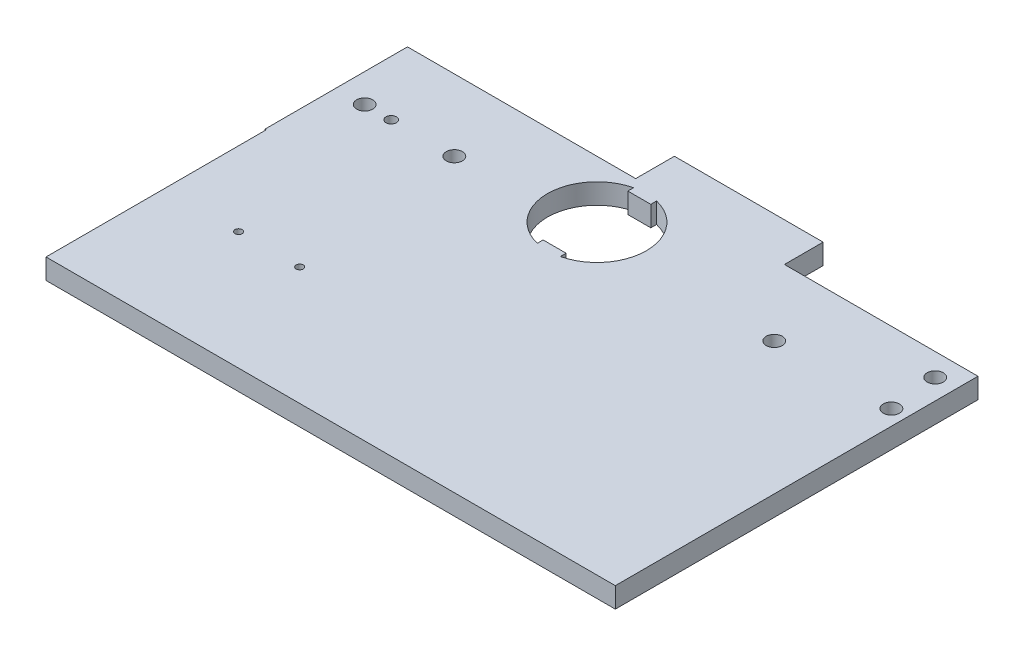
ISO-10303-21;
HEADER;
FILE_DESCRIPTION(('STEP AP214'),'2;1');
FILE_NAME('part.step','',(''),(''),'','','');
FILE_SCHEMA(('AUTOMOTIVE_DESIGN { 1 0 10303 214 1 1 1 1 }'));
ENDSEC;
DATA;
#1=APPLICATION_CONTEXT('core data for automotive mechanical design processes');
#2=APPLICATION_PROTOCOL_DEFINITION('international standard','automotive_design',2000,#1);
#3=PRODUCT_CONTEXT('',#1,'mechanical');
#4=PRODUCT('Part','Part','',(#3));
#5=PRODUCT_RELATED_PRODUCT_CATEGORY('part','',(#4));
#6=PRODUCT_DEFINITION_FORMATION('','',#4);
#7=PRODUCT_DEFINITION_CONTEXT('part definition',#1,'design');
#8=PRODUCT_DEFINITION('design','',#6,#7);
#9=PRODUCT_DEFINITION_SHAPE('','',#8);
#10=(LENGTH_UNIT() NAMED_UNIT(*) SI_UNIT(.MILLI.,.METRE.));
#11=(NAMED_UNIT(*) PLANE_ANGLE_UNIT() SI_UNIT($,.RADIAN.));
#12=(NAMED_UNIT(*) SI_UNIT($,.STERADIAN.) SOLID_ANGLE_UNIT());
#13=UNCERTAINTY_MEASURE_WITH_UNIT(LENGTH_MEASURE(1.E-05),#10,'distance_accuracy_value','');
#14=(GEOMETRIC_REPRESENTATION_CONTEXT(3) GLOBAL_UNCERTAINTY_ASSIGNED_CONTEXT((#13)) GLOBAL_UNIT_ASSIGNED_CONTEXT((#10,
#11,#12)) REPRESENTATION_CONTEXT('',''));
#15=CARTESIAN_POINT('',(0.,0.,0.));
#16=DIRECTION('',(0.,0.,1.));
#17=DIRECTION('',(1.,0.,0.));
#18=AXIS2_PLACEMENT_3D('',#15,#16,#17);
#19=CARTESIAN_POINT('',(0.,10.,-70.));
#20=DIRECTION('',(0.,0.,-1.));
#21=DIRECTION('',(-1.,0.,0.));
#22=AXIS2_PLACEMENT_3D('',#19,#20,#21);
#23=PLANE('',#22);
#24=DIRECTION('',(0.,-1.,0.));
#25=VECTOR('',#24,1.);
#26=CARTESIAN_POINT('',(185.,10.0000000000001,-70.));
#27=LINE('',#26,#25);
#28=CARTESIAN_POINT('',(185.,10.,-70.));
#29=VERTEX_POINT('',#28);
#30=CARTESIAN_POINT('',(185.,0.,-70.));
#31=VERTEX_POINT('',#30);
#32=EDGE_CURVE('E54',#29,#31,#27,.T.);
#33=ORIENTED_EDGE('',*,*,#32,.F.);
#34=DIRECTION('',(1.,0.,0.));
#35=VECTOR('',#34,1.);
#36=CARTESIAN_POINT('',(0.,10.,-70.));
#37=LINE('',#36,#35);
#38=CARTESIAN_POINT('',(280.,10.,-70.));
#39=VERTEX_POINT('',#38);
#40=EDGE_CURVE('E281',#29,#39,#37,.T.);
#41=ORIENTED_EDGE('',*,*,#40,.T.);
#42=DIRECTION('',(0.,-1.,0.));
#43=VECTOR('',#42,1.);
#44=CARTESIAN_POINT('',(280.,10.,-70.));
#45=LINE('',#44,#43);
#46=CARTESIAN_POINT('',(280.,0.,-70.));
#47=VERTEX_POINT('',#46);
#48=EDGE_CURVE('E11',#39,#47,#45,.T.);
#49=ORIENTED_EDGE('',*,*,#48,.T.);
#50=DIRECTION('',(1.,0.,0.));
#51=VECTOR('',#50,1.);
#52=CARTESIAN_POINT('',(0.,0.,-70.));
#53=LINE('',#52,#51);
#54=EDGE_CURVE('E58',#31,#47,#53,.T.);
#55=ORIENTED_EDGE('',*,*,#54,.F.);
#56=EDGE_LOOP('',(#33,#41,#49,#55));
#57=FACE_BOUND('',#56,.T.);
#58=ADVANCED_FACE('F37',(#57),#23,.T.);
#59=CARTESIAN_POINT('',(0.,10.,0.));
#60=DIRECTION('',(0.,0.,-1.));
#61=DIRECTION('',(-1.,0.,0.));
#62=AXIS2_PLACEMENT_3D('',#59,#60,#61);
#63=PLANE('',#62);
#64=DIRECTION('',(1.,0.,0.));
#65=VECTOR('',#64,1.);
#66=CARTESIAN_POINT('',(0.,0.,0.));
#67=LINE('',#66,#65);
#68=CARTESIAN_POINT('',(0.,0.,0.));
#69=VERTEX_POINT('',#68);
#70=CARTESIAN_POINT('',(0.600000000000045,0.,0.));
#71=VERTEX_POINT('',#70);
#72=EDGE_CURVE('E272',#69,#71,#67,.T.);
#73=ORIENTED_EDGE('',*,*,#72,.T.);
#74=DIRECTION('',(0.,1.,0.));
#75=VECTOR('',#74,1.);
#76=CARTESIAN_POINT('',(0.600000000000045,0.,0.));
#77=LINE('',#76,#75);
#78=CARTESIAN_POINT('',(0.600000000000045,10.,0.));
#79=VERTEX_POINT('',#78);
#80=EDGE_CURVE('E240',#71,#79,#77,.T.);
#81=ORIENTED_EDGE('',*,*,#80,.T.);
#82=DIRECTION('',(1.,0.,0.));
#83=VECTOR('',#82,1.);
#84=CARTESIAN_POINT('',(0.,10.,0.));
#85=LINE('',#84,#83);
#86=CARTESIAN_POINT('',(0.,10.,0.));
#87=VERTEX_POINT('',#86);
#88=EDGE_CURVE('E274',#87,#79,#85,.T.);
#89=ORIENTED_EDGE('',*,*,#88,.F.);
#90=DIRECTION('',(0.,-1.,0.));
#91=VECTOR('',#90,1.);
#92=CARTESIAN_POINT('',(0.,10.,0.));
#93=LINE('',#92,#91);
#94=EDGE_CURVE('E305',#87,#69,#93,.T.);
#95=ORIENTED_EDGE('',*,*,#94,.T.);
#96=EDGE_LOOP('',(#73,#81,#89,#95));
#97=FACE_BOUND('',#96,.T.);
#98=ADVANCED_FACE('F39',(#97),#63,.F.);
#99=CARTESIAN_POINT('',(280.,10.,0.));
#100=DIRECTION('',(-1.,0.,0.));
#101=DIRECTION('',(0.,0.,1.));
#102=AXIS2_PLACEMENT_3D('',#99,#100,#101);
#103=PLANE('',#102);
#104=ORIENTED_EDGE('',*,*,#48,.F.);
#105=DIRECTION('',(0.,0.,-1.));
#106=VECTOR('',#105,1.);
#107=CARTESIAN_POINT('',(280.,10.,0.));
#108=LINE('',#107,#106);
#109=CARTESIAN_POINT('',(280.,10.,108.));
#110=VERTEX_POINT('',#109);
#111=EDGE_CURVE('E277',#110,#39,#108,.T.);
#112=ORIENTED_EDGE('',*,*,#111,.F.);
#113=DIRECTION('',(0.,1.,0.));
#114=VECTOR('',#113,1.);
#115=CARTESIAN_POINT('',(280.,0.,108.));
#116=LINE('',#115,#114);
#117=CARTESIAN_POINT('',(280.,0.,108.));
#118=VERTEX_POINT('',#117);
#119=EDGE_CURVE('E258',#118,#110,#116,.T.);
#120=ORIENTED_EDGE('',*,*,#119,.F.);
#121=DIRECTION('',(0.,0.,-1.));
#122=VECTOR('',#121,1.);
#123=CARTESIAN_POINT('',(280.,0.,0.));
#124=LINE('',#123,#122);
#125=EDGE_CURVE('E308',#118,#47,#124,.T.);
#126=ORIENTED_EDGE('',*,*,#125,.T.);
#127=EDGE_LOOP('',(#104,#112,#120,#126));
#128=FACE_BOUND('',#127,.T.);
#129=ADVANCED_FACE('F361',(#128),#103,.F.);
#130=DIRECTION('',(0.,1.,0.));
#131=VECTOR('',#130,1.);
#132=CARTESIAN_POINT('',(112.,10.0000000000001,-70.));
#133=LINE('',#132,#131);
#134=CARTESIAN_POINT('',(112.,0.,-70.));
#135=VERTEX_POINT('',#134);
#136=CARTESIAN_POINT('',(112.,10.0000000000001,-70.));
#137=VERTEX_POINT('',#136);
#138=EDGE_CURVE('E182',#135,#137,#133,.T.);
#139=ORIENTED_EDGE('',*,*,#138,.F.);
#140=CARTESIAN_POINT('',(0.,0.,-70.));
#141=VERTEX_POINT('',#140);
#142=EDGE_CURVE('E311',#141,#135,#53,.T.);
#143=ORIENTED_EDGE('',*,*,#142,.F.);
#144=DIRECTION('',(0.,-1.,0.));
#145=VECTOR('',#144,1.);
#146=CARTESIAN_POINT('',(0.,10.,-70.));
#147=LINE('',#146,#145);
#148=CARTESIAN_POINT('',(0.,10.,-70.));
#149=VERTEX_POINT('',#148);
#150=EDGE_CURVE('E46',#149,#141,#147,.T.);
#151=ORIENTED_EDGE('',*,*,#150,.F.);
#152=EDGE_CURVE('E282',#149,#137,#37,.T.);
#153=ORIENTED_EDGE('',*,*,#152,.T.);
#154=EDGE_LOOP('',(#139,#143,#151,#153));
#155=FACE_BOUND('',#154,.T.);
#156=ADVANCED_FACE('F357',(#155),#23,.T.);
#157=CARTESIAN_POINT('',(270.,10.,-59.));
#158=DIRECTION('',(0.,-1.,0.));
#159=DIRECTION('',(0.,0.,-1.));
#160=AXIS2_PLACEMENT_3D('',#157,#158,#159);
#161=CYLINDRICAL_SURFACE('',#160,3.96875000000005);
#162=CARTESIAN_POINT('',(270.,10.,-59.));
#163=DIRECTION('',(0.,1.,0.));
#164=DIRECTION('',(0.,0.,1.));
#165=AXIS2_PLACEMENT_3D('',#162,#163,#164);
#166=CIRCLE('',#165,3.96875000000005);
#167=CARTESIAN_POINT('',(270.,10.,-55.03125));
#168=VERTEX_POINT('',#167);
#169=EDGE_CURVE('E299',#168,#168,#166,.T.);
#170=ORIENTED_EDGE('',*,*,#169,.T.);
#171=EDGE_LOOP('',(#170));
#172=FACE_BOUND('',#171,.T.);
#173=CARTESIAN_POINT('',(270.,0.,-59.));
#174=DIRECTION('',(0.,1.,0.));
#175=DIRECTION('',(0.,0.,1.));
#176=AXIS2_PLACEMENT_3D('',#173,#174,#175);
#177=CIRCLE('',#176,3.96875000000005);
#178=CARTESIAN_POINT('',(270.,0.,-55.03125));
#179=VERTEX_POINT('',#178);
#180=EDGE_CURVE('E328',#179,#179,#177,.T.);
#181=ORIENTED_EDGE('',*,*,#180,.F.);
#182=EDGE_LOOP('',(#181));
#183=FACE_BOUND('',#182,.T.);
#184=ADVANCED_FACE('F365',(#172,#183),#161,.F.);
#185=CARTESIAN_POINT('',(272.5,10.,-35.));
#186=DIRECTION('',(0.,-1.,0.));
#187=DIRECTION('',(0.,0.,-1.));
#188=AXIS2_PLACEMENT_3D('',#185,#186,#187);
#189=CYLINDRICAL_SURFACE('',#188,3.96874999999999);
#190=CARTESIAN_POINT('',(272.5,10.,-35.));
#191=DIRECTION('',(0.,1.,0.));
#192=DIRECTION('',(0.,0.,1.));
#193=AXIS2_PLACEMENT_3D('',#190,#191,#192);
#194=CIRCLE('',#193,3.96874999999999);
#195=CARTESIAN_POINT('',(272.5,10.,-31.03125));
#196=VERTEX_POINT('',#195);
#197=EDGE_CURVE('E296',#196,#196,#194,.T.);
#198=ORIENTED_EDGE('',*,*,#197,.T.);
#199=EDGE_LOOP('',(#198));
#200=FACE_BOUND('',#199,.T.);
#201=CARTESIAN_POINT('',(272.5,0.,-35.));
#202=DIRECTION('',(0.,1.,0.));
#203=DIRECTION('',(0.,0.,1.));
#204=AXIS2_PLACEMENT_3D('',#201,#202,#203);
#205=CIRCLE('',#204,3.96874999999999);
#206=CARTESIAN_POINT('',(272.5,0.,-31.03125));
#207=VERTEX_POINT('',#206);
#208=EDGE_CURVE('E325',#207,#207,#205,.T.);
#209=ORIENTED_EDGE('',*,*,#208,.F.);
#210=EDGE_LOOP('',(#209));
#211=FACE_BOUND('',#210,.T.);
#212=ADVANCED_FACE('F371',(#200,#211),#189,.F.);
#213=CARTESIAN_POINT('',(58.,10.,-35.));
#214=DIRECTION('',(0.,-1.,0.));
#215=DIRECTION('',(0.,0.,-1.));
#216=AXIS2_PLACEMENT_3D('',#213,#214,#215);
#217=CYLINDRICAL_SURFACE('',#216,3.96875000000001);
#218=CARTESIAN_POINT('',(58.,10.,-35.));
#219=DIRECTION('',(0.,1.,0.));
#220=DIRECTION('',(0.,0.,1.));
#221=AXIS2_PLACEMENT_3D('',#218,#219,#220);
#222=CIRCLE('',#221,3.96875000000001);
#223=CARTESIAN_POINT('',(58.,10.,-31.03125));
#224=VERTEX_POINT('',#223);
#225=EDGE_CURVE('E293',#224,#224,#222,.T.);
#226=ORIENTED_EDGE('',*,*,#225,.T.);
#227=EDGE_LOOP('',(#226));
#228=FACE_BOUND('',#227,.T.);
#229=CARTESIAN_POINT('',(58.,0.,-35.));
#230=DIRECTION('',(0.,1.,0.));
#231=DIRECTION('',(0.,0.,1.));
#232=AXIS2_PLACEMENT_3D('',#229,#230,#231);
#233=CIRCLE('',#232,3.96875000000001);
#234=CARTESIAN_POINT('',(58.,0.,-31.03125));
#235=VERTEX_POINT('',#234);
#236=EDGE_CURVE('E322',#235,#235,#233,.T.);
#237=ORIENTED_EDGE('',*,*,#236,.F.);
#238=EDGE_LOOP('',(#237));
#239=FACE_BOUND('',#238,.T.);
#240=ADVANCED_FACE('F422',(#228,#239),#217,.F.);
#241=CARTESIAN_POINT('',(14.,10.,-35.));
#242=DIRECTION('',(0.,-1.,0.));
#243=DIRECTION('',(0.,0.,-1.));
#244=AXIS2_PLACEMENT_3D('',#241,#242,#243);
#245=CYLINDRICAL_SURFACE('',#244,3.96875);
#246=CARTESIAN_POINT('',(14.,10.,-35.));
#247=DIRECTION('',(0.,1.,0.));
#248=DIRECTION('',(0.,0.,1.));
#249=AXIS2_PLACEMENT_3D('',#246,#247,#248);
#250=CIRCLE('',#249,3.96875);
#251=CARTESIAN_POINT('',(14.,10.,-31.03125));
#252=VERTEX_POINT('',#251);
#253=EDGE_CURVE('E290',#252,#252,#250,.T.);
#254=ORIENTED_EDGE('',*,*,#253,.T.);
#255=EDGE_LOOP('',(#254));
#256=FACE_BOUND('',#255,.T.);
#257=CARTESIAN_POINT('',(14.,0.,-35.));
#258=DIRECTION('',(0.,1.,0.));
#259=DIRECTION('',(0.,0.,1.));
#260=AXIS2_PLACEMENT_3D('',#257,#258,#259);
#261=CIRCLE('',#260,3.96875);
#262=CARTESIAN_POINT('',(14.,0.,-31.03125));
#263=VERTEX_POINT('',#262);
#264=EDGE_CURVE('E319',#263,#263,#261,.T.);
#265=ORIENTED_EDGE('',*,*,#264,.F.);
#266=EDGE_LOOP('',(#265));
#267=FACE_BOUND('',#266,.T.);
#268=ADVANCED_FACE('F416',(#256,#267),#245,.F.);
#269=CARTESIAN_POINT('',(27.,10.,-35.));
#270=DIRECTION('',(0.,-1.,0.));
#271=DIRECTION('',(0.,0.,-1.));
#272=AXIS2_PLACEMENT_3D('',#269,#270,#271);
#273=CYLINDRICAL_SURFACE('',#272,2.54999999999999);
#274=CARTESIAN_POINT('',(27.,10.,-35.));
#275=DIRECTION('',(0.,1.,0.));
#276=DIRECTION('',(0.,0.,1.));
#277=AXIS2_PLACEMENT_3D('',#274,#275,#276);
#278=CIRCLE('',#277,2.54999999999999);
#279=CARTESIAN_POINT('',(27.,10.,-32.45));
#280=VERTEX_POINT('',#279);
#281=EDGE_CURVE('E287',#280,#280,#278,.T.);
#282=ORIENTED_EDGE('',*,*,#281,.T.);
#283=EDGE_LOOP('',(#282));
#284=FACE_BOUND('',#283,.T.);
#285=CARTESIAN_POINT('',(27.,0.,-35.));
#286=DIRECTION('',(0.,1.,0.));
#287=DIRECTION('',(0.,0.,1.));
#288=AXIS2_PLACEMENT_3D('',#285,#286,#287);
#289=CIRCLE('',#288,2.54999999999999);
#290=CARTESIAN_POINT('',(27.,0.,-32.45));
#291=VERTEX_POINT('',#290);
#292=EDGE_CURVE('E316',#291,#291,#289,.T.);
#293=ORIENTED_EDGE('',*,*,#292,.F.);
#294=EDGE_LOOP('',(#293));
#295=FACE_BOUND('',#294,.T.);
#296=ADVANCED_FACE('F409',(#284,#295),#273,.F.);
#297=CARTESIAN_POINT('',(0.,10.,0.));
#298=DIRECTION('',(-1.,0.,0.));
#299=DIRECTION('',(0.,0.,1.));
#300=AXIS2_PLACEMENT_3D('',#297,#298,#299);
#301=PLANE('',#300);
#302=DIRECTION('',(0.,0.,-1.));
#303=VECTOR('',#302,1.);
#304=CARTESIAN_POINT('',(0.,0.,0.));
#305=LINE('',#304,#303);
#306=EDGE_CURVE('E313',#69,#141,#305,.T.);
#307=ORIENTED_EDGE('',*,*,#306,.F.);
#308=ORIENTED_EDGE('',*,*,#94,.F.);
#309=DIRECTION('',(0.,0.,-1.));
#310=VECTOR('',#309,1.);
#311=CARTESIAN_POINT('',(0.,10.,0.));
#312=LINE('',#311,#310);
#313=EDGE_CURVE('E284',#87,#149,#312,.T.);
#314=ORIENTED_EDGE('',*,*,#313,.T.);
#315=ORIENTED_EDGE('',*,*,#150,.T.);
#316=EDGE_LOOP('',(#307,#308,#314,#315));
#317=FACE_BOUND('',#316,.T.);
#318=ADVANCED_FACE('F405',(#317),#301,.T.);
#319=CARTESIAN_POINT('',(215.,10.,-35.));
#320=DIRECTION('',(0.,-1.,0.));
#321=DIRECTION('',(0.,0.,-1.));
#322=AXIS2_PLACEMENT_3D('',#319,#320,#321);
#323=CYLINDRICAL_SURFACE('',#322,3.96874999999999);
#324=CARTESIAN_POINT('',(215.,10.,-35.));
#325=DIRECTION('',(0.,1.,0.));
#326=DIRECTION('',(0.,0.,1.));
#327=AXIS2_PLACEMENT_3D('',#324,#325,#326);
#328=CIRCLE('',#327,3.96874999999999);
#329=CARTESIAN_POINT('',(215.,10.,-31.03125));
#330=VERTEX_POINT('',#329);
#331=EDGE_CURVE('E302',#330,#330,#328,.T.);
#332=ORIENTED_EDGE('',*,*,#331,.T.);
#333=EDGE_LOOP('',(#332));
#334=FACE_BOUND('',#333,.T.);
#335=CARTESIAN_POINT('',(215.,0.,-35.));
#336=DIRECTION('',(0.,1.,0.));
#337=DIRECTION('',(0.,0.,1.));
#338=AXIS2_PLACEMENT_3D('',#335,#336,#337);
#339=CIRCLE('',#338,3.96874999999999);
#340=CARTESIAN_POINT('',(215.,0.,-31.03125));
#341=VERTEX_POINT('',#340);
#342=EDGE_CURVE('E278',#341,#341,#339,.T.);
#343=ORIENTED_EDGE('',*,*,#342,.F.);
#344=EDGE_LOOP('',(#343));
#345=FACE_BOUND('',#344,.T.);
#346=ADVANCED_FACE('F408',(#334,#345),#323,.F.);
#347=CARTESIAN_POINT('',(0.,10.,0.));
#348=DIRECTION('',(0.,1.,0.));
#349=DIRECTION('',(0.,0.,1.));
#350=AXIS2_PLACEMENT_3D('',#347,#348,#349);
#351=PLANE('',#350);
#352=ORIENTED_EDGE('',*,*,#88,.T.);
#353=DIRECTION('',(0.,0.,-1.));
#354=VECTOR('',#353,1.);
#355=CARTESIAN_POINT('',(0.600000000000045,10.,108.));
#356=LINE('',#355,#354);
#357=CARTESIAN_POINT('',(0.600000000000045,10.,108.));
#358=VERTEX_POINT('',#357);
#359=EDGE_CURVE('E270',#358,#79,#356,.T.);
#360=ORIENTED_EDGE('',*,*,#359,.F.);
#361=DIRECTION('',(1.,0.,0.));
#362=VECTOR('',#361,1.);
#363=CARTESIAN_POINT('',(0.600000000000045,10.,108.));
#364=LINE('',#363,#362);
#365=EDGE_CURVE('E255',#358,#110,#364,.T.);
#366=ORIENTED_EDGE('',*,*,#365,.T.);
#367=ORIENTED_EDGE('',*,*,#111,.T.);
#368=ORIENTED_EDGE('',*,*,#40,.F.);
#369=DIRECTION('',(0.,0.,1.));
#370=VECTOR('',#369,1.);
#371=CARTESIAN_POINT('',(185.,10.0000000000001,-89.));
#372=LINE('',#371,#370);
#373=CARTESIAN_POINT('',(185.,10.0000000000001,-89.));
#374=VERTEX_POINT('',#373);
#375=EDGE_CURVE('E386',#374,#29,#372,.T.);
#376=ORIENTED_EDGE('',*,*,#375,.F.);
#377=DIRECTION('',(1.,0.,0.));
#378=VECTOR('',#377,1.);
#379=CARTESIAN_POINT('',(185.,10.0000000000001,-89.));
#380=LINE('',#379,#378);
#381=CARTESIAN_POINT('',(112.,10.0000000000001,-89.));
#382=VERTEX_POINT('',#381);
#383=EDGE_CURVE('E178',#382,#374,#380,.T.);
#384=ORIENTED_EDGE('',*,*,#383,.F.);
#385=DIRECTION('',(0.,0.,1.));
#386=VECTOR('',#385,1.);
#387=CARTESIAN_POINT('',(112.,10.0000000000001,-89.));
#388=LINE('',#387,#386);
#389=EDGE_CURVE('E189',#382,#137,#388,.T.);
#390=ORIENTED_EDGE('',*,*,#389,.T.);
#391=ORIENTED_EDGE('',*,*,#152,.F.);
#392=ORIENTED_EDGE('',*,*,#313,.F.);
#393=EDGE_LOOP('',(#352,#360,#366,#367,#368,#376,#384,#390,#391,#392));
#394=FACE_BOUND('',#393,.T.);
#395=DIRECTION('',(0.,0.,1.));
#396=VECTOR('',#395,1.);
#397=CARTESIAN_POINT('',(126.639279667043,10.,-6.93016017500666E-13));
#398=LINE('',#397,#396);
#399=CARTESIAN_POINT('',(126.639279667043,10.,-21.22));
#400=VERTEX_POINT('',#399);
#401=CARTESIAN_POINT('',(126.639279667043,10.,-18.3839689016787));
#402=VERTEX_POINT('',#401);
#403=EDGE_CURVE('E218',#400,#402,#398,.T.);
#404=ORIENTED_EDGE('',*,*,#403,.F.);
#405=DIRECTION('',(1.,0.,0.));
#406=VECTOR('',#405,1.);
#407=CARTESIAN_POINT('',(0.,10.,-21.22));
#408=LINE('',#407,#406);
#409=CARTESIAN_POINT('',(115.360720332957,10.,-21.22));
#410=VERTEX_POINT('',#409);
#411=EDGE_CURVE('E201',#410,#400,#408,.T.);
#412=ORIENTED_EDGE('',*,*,#411,.F.);
#413=DIRECTION('',(0.,0.,1.));
#414=VECTOR('',#413,1.);
#415=CARTESIAN_POINT('',(115.360720332957,10.,3.15647827401374E-13));
#416=LINE('',#415,#414);
#417=CARTESIAN_POINT('',(115.360720332957,10.,-18.3839689016787));
#418=VERTEX_POINT('',#417);
#419=EDGE_CURVE('E233',#410,#418,#416,.T.);
#420=ORIENTED_EDGE('',*,*,#419,.T.);
#421=CARTESIAN_POINT('',(121.,10.,-42.));
#422=DIRECTION('',(0.,1.,0.));
#423=DIRECTION('',(0.,0.,1.));
#424=AXIS2_PLACEMENT_3D('',#421,#422,#423);
#425=CIRCLE('',#424,24.28);
#426=CARTESIAN_POINT('',(115.360720332957,10.,-65.6160310983213));
#427=VERTEX_POINT('',#426);
#428=EDGE_CURVE('E224',#427,#418,#425,.T.);
#429=ORIENTED_EDGE('',*,*,#428,.F.);
#430=DIRECTION('',(0.,0.,1.));
#431=VECTOR('',#430,1.);
#432=CARTESIAN_POINT('',(115.360720332957,10.,0.));
#433=LINE('',#432,#431);
#434=CARTESIAN_POINT('',(115.360720332957,10.,-62.78));
#435=VERTEX_POINT('',#434);
#436=EDGE_CURVE('E230',#427,#435,#433,.T.);
#437=ORIENTED_EDGE('',*,*,#436,.T.);
#438=DIRECTION('',(1.,0.,0.));
#439=VECTOR('',#438,1.);
#440=CARTESIAN_POINT('',(0.,10.,-62.78));
#441=LINE('',#440,#439);
#442=CARTESIAN_POINT('',(126.639279667043,10.,-62.78));
#443=VERTEX_POINT('',#442);
#444=EDGE_CURVE('E227',#435,#443,#441,.T.);
#445=ORIENTED_EDGE('',*,*,#444,.T.);
#446=DIRECTION('',(0.,0.,1.));
#447=VECTOR('',#446,1.);
#448=CARTESIAN_POINT('',(126.639279667043,10.,0.));
#449=LINE('',#448,#447);
#450=CARTESIAN_POINT('',(126.639279667043,10.,-65.6160310983213));
#451=VERTEX_POINT('',#450);
#452=EDGE_CURVE('E223',#451,#443,#449,.T.);
#453=ORIENTED_EDGE('',*,*,#452,.F.);
#454=EDGE_CURVE('E220',#402,#451,#425,.T.);
#455=ORIENTED_EDGE('',*,*,#454,.F.);
#456=EDGE_LOOP('',(#404,#412,#420,#429,#437,#445,#453,#455));
#457=FACE_BOUND('',#456,.T.);
#458=ORIENTED_EDGE('',*,*,#281,.F.);
#459=EDGE_LOOP('',(#458));
#460=FACE_BOUND('',#459,.T.);
#461=ORIENTED_EDGE('',*,*,#253,.F.);
#462=EDGE_LOOP('',(#461));
#463=FACE_BOUND('',#462,.T.);
#464=ORIENTED_EDGE('',*,*,#225,.F.);
#465=EDGE_LOOP('',(#464));
#466=FACE_BOUND('',#465,.T.);
#467=ORIENTED_EDGE('',*,*,#197,.F.);
#468=EDGE_LOOP('',(#467));
#469=FACE_BOUND('',#468,.T.);
#470=ORIENTED_EDGE('',*,*,#169,.F.);
#471=EDGE_LOOP('',(#470));
#472=FACE_BOUND('',#471,.T.);
#473=ORIENTED_EDGE('',*,*,#331,.F.);
#474=EDGE_LOOP('',(#473));
#475=FACE_BOUND('',#474,.T.);
#476=CARTESIAN_POINT('',(37.1000000000001,10.,50.0000000000001));
#477=DIRECTION('',(0.,1.,0.));
#478=DIRECTION('',(0.,0.,1.));
#479=AXIS2_PLACEMENT_3D('',#476,#477,#478);
#480=CIRCLE('',#479,1.7526);
#481=CARTESIAN_POINT('',(37.1000000000001,10.,51.7526000000001));
#482=VERTEX_POINT('',#481);
#483=EDGE_CURVE('E193',#482,#482,#480,.T.);
#484=ORIENTED_EDGE('',*,*,#483,.F.);
#485=EDGE_LOOP('',(#484));
#486=FACE_BOUND('',#485,.T.);
#487=CARTESIAN_POINT('',(67.1,10.,50.0000000000001));
#488=DIRECTION('',(0.,1.,0.));
#489=DIRECTION('',(0.,0.,1.));
#490=AXIS2_PLACEMENT_3D('',#487,#488,#489);
#491=CIRCLE('',#490,1.7526);
#492=CARTESIAN_POINT('',(67.1,10.,51.7526000000001));
#493=VERTEX_POINT('',#492);
#494=EDGE_CURVE('E185',#493,#493,#491,.T.);
#495=ORIENTED_EDGE('',*,*,#494,.F.);
#496=EDGE_LOOP('',(#495));
#497=FACE_BOUND('',#496,.T.);
#498=ADVANCED_FACE('F391',(#394,#457,#460,#463,#466,#469,#472,#475,#486,#497),#351,.T.);
#499=CARTESIAN_POINT('',(0.,0.,0.));
#500=DIRECTION('',(0.,1.,0.));
#501=DIRECTION('',(0.,0.,1.));
#502=AXIS2_PLACEMENT_3D('',#499,#500,#501);
#503=PLANE('',#502);
#504=DIRECTION('',(1.,0.,0.));
#505=VECTOR('',#504,1.);
#506=CARTESIAN_POINT('',(0.,0.,-21.22));
#507=LINE('',#506,#505);
#508=CARTESIAN_POINT('',(115.360720332957,0.,-21.22));
#509=VERTEX_POINT('',#508);
#510=CARTESIAN_POINT('',(126.639279667043,0.,-21.22));
#511=VERTEX_POINT('',#510);
#512=EDGE_CURVE('E214',#509,#511,#507,.T.);
#513=ORIENTED_EDGE('',*,*,#512,.T.);
#514=DIRECTION('',(0.,0.,1.));
#515=VECTOR('',#514,1.);
#516=CARTESIAN_POINT('',(126.639279667043,0.,-6.93016017500666E-13));
#517=LINE('',#516,#515);
#518=CARTESIAN_POINT('',(126.639279667043,0.,-18.3839689016787));
#519=VERTEX_POINT('',#518);
#520=EDGE_CURVE('E197',#511,#519,#517,.T.);
#521=ORIENTED_EDGE('',*,*,#520,.T.);
#522=CARTESIAN_POINT('',(121.,0.,-42.));
#523=DIRECTION('',(0.,1.,0.));
#524=DIRECTION('',(0.,0.,1.));
#525=AXIS2_PLACEMENT_3D('',#522,#523,#524);
#526=CIRCLE('',#525,24.28);
#527=CARTESIAN_POINT('',(126.639279667043,0.,-65.6160310983213));
#528=VERTEX_POINT('',#527);
#529=EDGE_CURVE('E200',#519,#528,#526,.T.);
#530=ORIENTED_EDGE('',*,*,#529,.T.);
#531=DIRECTION('',(0.,0.,1.));
#532=VECTOR('',#531,1.);
#533=CARTESIAN_POINT('',(126.639279667043,0.,0.));
#534=LINE('',#533,#532);
#535=CARTESIAN_POINT('',(126.639279667043,0.,-62.78));
#536=VERTEX_POINT('',#535);
#537=EDGE_CURVE('E204',#528,#536,#534,.T.);
#538=ORIENTED_EDGE('',*,*,#537,.T.);
#539=DIRECTION('',(1.,0.,0.));
#540=VECTOR('',#539,1.);
#541=CARTESIAN_POINT('',(0.,0.,-62.78));
#542=LINE('',#541,#540);
#543=CARTESIAN_POINT('',(115.360720332957,0.,-62.78));
#544=VERTEX_POINT('',#543);
#545=EDGE_CURVE('E208',#544,#536,#542,.T.);
#546=ORIENTED_EDGE('',*,*,#545,.F.);
#547=DIRECTION('',(0.,0.,1.));
#548=VECTOR('',#547,1.);
#549=CARTESIAN_POINT('',(115.360720332957,0.,0.));
#550=LINE('',#549,#548);
#551=CARTESIAN_POINT('',(115.360720332957,0.,-65.6160310983213));
#552=VERTEX_POINT('',#551);
#553=EDGE_CURVE('E210',#552,#544,#550,.T.);
#554=ORIENTED_EDGE('',*,*,#553,.F.);
#555=CARTESIAN_POINT('',(115.360720332957,0.,-18.3839689016787));
#556=VERTEX_POINT('',#555);
#557=EDGE_CURVE('E205',#552,#556,#526,.T.);
#558=ORIENTED_EDGE('',*,*,#557,.T.);
#559=DIRECTION('',(0.,0.,1.));
#560=VECTOR('',#559,1.);
#561=CARTESIAN_POINT('',(115.360720332957,0.,3.15647827401374E-13));
#562=LINE('',#561,#560);
#563=EDGE_CURVE('E212',#509,#556,#562,.T.);
#564=ORIENTED_EDGE('',*,*,#563,.F.);
#565=EDGE_LOOP('',(#513,#521,#530,#538,#546,#554,#558,#564));
#566=FACE_BOUND('',#565,.T.);
#567=ORIENTED_EDGE('',*,*,#142,.T.);
#568=DIRECTION('',(0.,0.,1.));
#569=VECTOR('',#568,1.);
#570=CARTESIAN_POINT('',(112.,0.,-89.));
#571=LINE('',#570,#569);
#572=CARTESIAN_POINT('',(112.,0.,-89.));
#573=VERTEX_POINT('',#572);
#574=EDGE_CURVE('E169',#573,#135,#571,.T.);
#575=ORIENTED_EDGE('',*,*,#574,.F.);
#576=DIRECTION('',(-1.,0.,0.));
#577=VECTOR('',#576,1.);
#578=CARTESIAN_POINT('',(185.,0.,-89.));
#579=LINE('',#578,#577);
#580=CARTESIAN_POINT('',(185.,0.,-89.));
#581=VERTEX_POINT('',#580);
#582=EDGE_CURVE('E161',#581,#573,#579,.T.);
#583=ORIENTED_EDGE('',*,*,#582,.F.);
#584=DIRECTION('',(0.,0.,1.));
#585=VECTOR('',#584,1.);
#586=CARTESIAN_POINT('',(185.,0.,-89.));
#587=LINE('',#586,#585);
#588=EDGE_CURVE('E167',#581,#31,#587,.T.);
#589=ORIENTED_EDGE('',*,*,#588,.T.);
#590=ORIENTED_EDGE('',*,*,#54,.T.);
#591=ORIENTED_EDGE('',*,*,#125,.F.);
#592=DIRECTION('',(1.,0.,0.));
#593=VECTOR('',#592,1.);
#594=CARTESIAN_POINT('',(0.600000000000045,0.,108.));
#595=LINE('',#594,#593);
#596=CARTESIAN_POINT('',(0.600000000000045,0.,108.));
#597=VERTEX_POINT('',#596);
#598=EDGE_CURVE('E261',#597,#118,#595,.T.);
#599=ORIENTED_EDGE('',*,*,#598,.F.);
#600=DIRECTION('',(0.,0.,-1.));
#601=VECTOR('',#600,1.);
#602=CARTESIAN_POINT('',(0.600000000000045,0.,108.));
#603=LINE('',#602,#601);
#604=EDGE_CURVE('E267',#597,#71,#603,.T.);
#605=ORIENTED_EDGE('',*,*,#604,.T.);
#606=ORIENTED_EDGE('',*,*,#72,.F.);
#607=ORIENTED_EDGE('',*,*,#306,.T.);
#608=EDGE_LOOP('',(#567,#575,#583,#589,#590,#591,#599,#605,#606,#607));
#609=FACE_BOUND('',#608,.T.);
#610=ORIENTED_EDGE('',*,*,#292,.T.);
#611=EDGE_LOOP('',(#610));
#612=FACE_BOUND('',#611,.T.);
#613=ORIENTED_EDGE('',*,*,#264,.T.);
#614=EDGE_LOOP('',(#613));
#615=FACE_BOUND('',#614,.T.);
#616=ORIENTED_EDGE('',*,*,#236,.T.);
#617=EDGE_LOOP('',(#616));
#618=FACE_BOUND('',#617,.T.);
#619=ORIENTED_EDGE('',*,*,#208,.T.);
#620=EDGE_LOOP('',(#619));
#621=FACE_BOUND('',#620,.T.);
#622=ORIENTED_EDGE('',*,*,#180,.T.);
#623=EDGE_LOOP('',(#622));
#624=FACE_BOUND('',#623,.T.);
#625=ORIENTED_EDGE('',*,*,#342,.T.);
#626=EDGE_LOOP('',(#625));
#627=FACE_BOUND('',#626,.T.);
#628=CARTESIAN_POINT('',(67.1,0.,50.0000000000001));
#629=DIRECTION('',(0.,1.,0.));
#630=DIRECTION('',(0.,0.,1.));
#631=AXIS2_PLACEMENT_3D('',#628,#629,#630);
#632=CIRCLE('',#631,1.7526);
#633=CARTESIAN_POINT('',(67.1,0.,51.7526000000001));
#634=VERTEX_POINT('',#633);
#635=EDGE_CURVE('E41',#634,#634,#632,.T.);
#636=ORIENTED_EDGE('',*,*,#635,.T.);
#637=EDGE_LOOP('',(#636));
#638=FACE_BOUND('',#637,.T.);
#639=CARTESIAN_POINT('',(37.1000000000001,0.,50.0000000000001));
#640=DIRECTION('',(0.,1.,0.));
#641=DIRECTION('',(0.,0.,1.));
#642=AXIS2_PLACEMENT_3D('',#639,#640,#641);
#643=CIRCLE('',#642,1.7526);
#644=CARTESIAN_POINT('',(37.1000000000001,0.,51.7526000000001));
#645=VERTEX_POINT('',#644);
#646=EDGE_CURVE('E196',#645,#645,#643,.T.);
#647=ORIENTED_EDGE('',*,*,#646,.T.);
#648=EDGE_LOOP('',(#647));
#649=FACE_BOUND('',#648,.T.);
#650=ADVANCED_FACE('F164',(#566,#609,#612,#615,#618,#621,#624,#627,#638,#649),#503,.F.);
#651=CARTESIAN_POINT('',(0.600000000000045,0.,108.));
#652=DIRECTION('',(-1.,0.,0.));
#653=DIRECTION('',(0.,0.,1.));
#654=AXIS2_PLACEMENT_3D('',#651,#652,#653);
#655=PLANE('',#654);
#656=ORIENTED_EDGE('',*,*,#80,.F.);
#657=ORIENTED_EDGE('',*,*,#604,.F.);
#658=DIRECTION('',(0.,1.,0.));
#659=VECTOR('',#658,1.);
#660=CARTESIAN_POINT('',(0.600000000000045,0.,108.));
#661=LINE('',#660,#659);
#662=EDGE_CURVE('E264',#597,#358,#661,.T.);
#663=ORIENTED_EDGE('',*,*,#662,.T.);
#664=ORIENTED_EDGE('',*,*,#359,.T.);
#665=EDGE_LOOP('',(#656,#657,#663,#664));
#666=FACE_BOUND('',#665,.T.);
#667=ADVANCED_FACE('F403',(#666),#655,.T.);
#668=CARTESIAN_POINT('',(0.,0.,108.));
#669=DIRECTION('',(0.,0.,1.));
#670=DIRECTION('',(1.,0.,0.));
#671=AXIS2_PLACEMENT_3D('',#668,#669,#670);
#672=PLANE('',#671);
#673=ORIENTED_EDGE('',*,*,#365,.F.);
#674=ORIENTED_EDGE('',*,*,#662,.F.);
#675=ORIENTED_EDGE('',*,*,#598,.T.);
#676=ORIENTED_EDGE('',*,*,#119,.T.);
#677=EDGE_LOOP('',(#673,#674,#675,#676));
#678=FACE_BOUND('',#677,.T.);
#679=ADVANCED_FACE('F400',(#678),#672,.T.);
#680=CARTESIAN_POINT('',(126.639279667043,0.,-6.93016017500666E-13));
#681=DIRECTION('',(-1.,0.,0.));
#682=DIRECTION('',(0.,0.,1.));
#683=AXIS2_PLACEMENT_3D('',#680,#681,#682);
#684=PLANE('',#683);
#685=ORIENTED_EDGE('',*,*,#403,.T.);
#686=DIRECTION('',(0.,1.,0.));
#687=VECTOR('',#686,1.);
#688=CARTESIAN_POINT('',(126.639279667043,0.,-18.3839689016787));
#689=LINE('',#688,#687);
#690=EDGE_CURVE('E217',#519,#402,#689,.T.);
#691=ORIENTED_EDGE('',*,*,#690,.F.);
#692=ORIENTED_EDGE('',*,*,#520,.F.);
#693=DIRECTION('',(0.,1.,0.));
#694=VECTOR('',#693,1.);
#695=CARTESIAN_POINT('',(126.639279667043,0.,-21.22));
#696=LINE('',#695,#694);
#697=EDGE_CURVE('E238',#511,#400,#696,.T.);
#698=ORIENTED_EDGE('',*,*,#697,.T.);
#699=EDGE_LOOP('',(#685,#691,#692,#698));
#700=FACE_BOUND('',#699,.T.);
#701=ADVANCED_FACE('F439',(#700),#684,.F.);
#702=CARTESIAN_POINT('',(0.,0.,-21.22));
#703=DIRECTION('',(0.,0.,1.));
#704=DIRECTION('',(1.,0.,0.));
#705=AXIS2_PLACEMENT_3D('',#702,#703,#704);
#706=PLANE('',#705);
#707=ORIENTED_EDGE('',*,*,#411,.T.);
#708=ORIENTED_EDGE('',*,*,#697,.F.);
#709=ORIENTED_EDGE('',*,*,#512,.F.);
#710=DIRECTION('',(0.,1.,0.));
#711=VECTOR('',#710,1.);
#712=CARTESIAN_POINT('',(115.360720332957,0.,-21.22));
#713=LINE('',#712,#711);
#714=EDGE_CURVE('E241',#509,#410,#713,.T.);
#715=ORIENTED_EDGE('',*,*,#714,.T.);
#716=EDGE_LOOP('',(#707,#708,#709,#715));
#717=FACE_BOUND('',#716,.T.);
#718=ADVANCED_FACE('F442',(#717),#706,.F.);
#719=CARTESIAN_POINT('',(115.360720332957,0.,3.15647827401374E-13));
#720=DIRECTION('',(-1.,0.,0.));
#721=DIRECTION('',(0.,0.,1.));
#722=AXIS2_PLACEMENT_3D('',#719,#720,#721);
#723=PLANE('',#722);
#724=ORIENTED_EDGE('',*,*,#419,.F.);
#725=ORIENTED_EDGE('',*,*,#714,.F.);
#726=ORIENTED_EDGE('',*,*,#563,.T.);
#727=DIRECTION('',(0.,1.,0.));
#728=VECTOR('',#727,1.);
#729=CARTESIAN_POINT('',(115.360720332957,0.,-18.3839689016787));
#730=LINE('',#729,#728);
#731=EDGE_CURVE('E243',#556,#418,#730,.T.);
#732=ORIENTED_EDGE('',*,*,#731,.T.);
#733=EDGE_LOOP('',(#724,#725,#726,#732));
#734=FACE_BOUND('',#733,.T.);
#735=ADVANCED_FACE('F456',(#734),#723,.T.);
#736=CARTESIAN_POINT('',(121.,0.,-42.));
#737=DIRECTION('',(0.,1.,0.));
#738=DIRECTION('',(0.,0.,1.));
#739=AXIS2_PLACEMENT_3D('',#736,#737,#738);
#740=CYLINDRICAL_SURFACE('',#739,24.28);
#741=ORIENTED_EDGE('',*,*,#428,.T.);
#742=ORIENTED_EDGE('',*,*,#731,.F.);
#743=ORIENTED_EDGE('',*,*,#557,.F.);
#744=DIRECTION('',(0.,1.,0.));
#745=VECTOR('',#744,1.);
#746=CARTESIAN_POINT('',(115.360720332957,0.,-65.6160310983213));
#747=LINE('',#746,#745);
#748=EDGE_CURVE('E245',#552,#427,#747,.T.);
#749=ORIENTED_EDGE('',*,*,#748,.T.);
#750=EDGE_LOOP('',(#741,#742,#743,#749));
#751=FACE_BOUND('',#750,.T.);
#752=ADVANCED_FACE('F353',(#751),#740,.F.);
#753=CARTESIAN_POINT('',(115.360720332957,0.,0.));
#754=DIRECTION('',(-1.,0.,0.));
#755=DIRECTION('',(0.,0.,1.));
#756=AXIS2_PLACEMENT_3D('',#753,#754,#755);
#757=PLANE('',#756);
#758=ORIENTED_EDGE('',*,*,#436,.F.);
#759=ORIENTED_EDGE('',*,*,#748,.F.);
#760=ORIENTED_EDGE('',*,*,#553,.T.);
#761=DIRECTION('',(0.,1.,0.));
#762=VECTOR('',#761,1.);
#763=CARTESIAN_POINT('',(115.360720332957,0.,-62.78));
#764=LINE('',#763,#762);
#765=EDGE_CURVE('E247',#544,#435,#764,.T.);
#766=ORIENTED_EDGE('',*,*,#765,.T.);
#767=EDGE_LOOP('',(#758,#759,#760,#766));
#768=FACE_BOUND('',#767,.T.);
#769=ADVANCED_FACE('F450',(#768),#757,.T.);
#770=CARTESIAN_POINT('',(0.,0.,-62.78));
#771=DIRECTION('',(0.,0.,1.));
#772=DIRECTION('',(1.,0.,0.));
#773=AXIS2_PLACEMENT_3D('',#770,#771,#772);
#774=PLANE('',#773);
#775=ORIENTED_EDGE('',*,*,#444,.F.);
#776=ORIENTED_EDGE('',*,*,#765,.F.);
#777=ORIENTED_EDGE('',*,*,#545,.T.);
#778=DIRECTION('',(0.,1.,0.));
#779=VECTOR('',#778,1.);
#780=CARTESIAN_POINT('',(126.639279667043,0.,-62.78));
#781=LINE('',#780,#779);
#782=EDGE_CURVE('E249',#536,#443,#781,.T.);
#783=ORIENTED_EDGE('',*,*,#782,.T.);
#784=EDGE_LOOP('',(#775,#776,#777,#783));
#785=FACE_BOUND('',#784,.T.);
#786=ADVANCED_FACE('F446',(#785),#774,.T.);
#787=CARTESIAN_POINT('',(126.639279667043,0.,0.));
#788=DIRECTION('',(-1.,0.,0.));
#789=DIRECTION('',(0.,0.,1.));
#790=AXIS2_PLACEMENT_3D('',#787,#788,#789);
#791=PLANE('',#790);
#792=ORIENTED_EDGE('',*,*,#452,.T.);
#793=ORIENTED_EDGE('',*,*,#782,.F.);
#794=ORIENTED_EDGE('',*,*,#537,.F.);
#795=DIRECTION('',(0.,1.,0.));
#796=VECTOR('',#795,1.);
#797=CARTESIAN_POINT('',(126.639279667043,0.,-65.6160310983213));
#798=LINE('',#797,#796);
#799=EDGE_CURVE('E251',#528,#451,#798,.T.);
#800=ORIENTED_EDGE('',*,*,#799,.T.);
#801=EDGE_LOOP('',(#792,#793,#794,#800));
#802=FACE_BOUND('',#801,.T.);
#803=ADVANCED_FACE('F350',(#802),#791,.F.);
#804=ORIENTED_EDGE('',*,*,#454,.T.);
#805=ORIENTED_EDGE('',*,*,#799,.F.);
#806=ORIENTED_EDGE('',*,*,#529,.F.);
#807=ORIENTED_EDGE('',*,*,#690,.T.);
#808=EDGE_LOOP('',(#804,#805,#806,#807));
#809=FACE_BOUND('',#808,.T.);
#810=ADVANCED_FACE('F341',(#809),#740,.F.);
#811=CARTESIAN_POINT('',(37.1000000000001,-25.,50.0000000000001));
#812=DIRECTION('',(0.,1.,0.));
#813=DIRECTION('',(0.,0.,1.));
#814=AXIS2_PLACEMENT_3D('',#811,#812,#813);
#815=CYLINDRICAL_SURFACE('',#814,1.7526);
#816=ORIENTED_EDGE('',*,*,#483,.T.);
#817=EDGE_LOOP('',(#816));
#818=FACE_BOUND('',#817,.T.);
#819=ORIENTED_EDGE('',*,*,#646,.F.);
#820=EDGE_LOOP('',(#819));
#821=FACE_BOUND('',#820,.T.);
#822=ADVANCED_FACE('F338',(#818,#821),#815,.F.);
#823=CARTESIAN_POINT('',(67.1,-22.,50.0000000000001));
#824=DIRECTION('',(0.,1.,0.));
#825=DIRECTION('',(0.,0.,1.));
#826=AXIS2_PLACEMENT_3D('',#823,#824,#825);
#827=CYLINDRICAL_SURFACE('',#826,1.7526);
#828=ORIENTED_EDGE('',*,*,#494,.T.);
#829=EDGE_LOOP('',(#828));
#830=FACE_BOUND('',#829,.T.);
#831=ORIENTED_EDGE('',*,*,#635,.F.);
#832=EDGE_LOOP('',(#831));
#833=FACE_BOUND('',#832,.T.);
#834=ADVANCED_FACE('F340',(#830,#833),#827,.F.);
#835=CARTESIAN_POINT('',(185.,10.0000000000001,-89.));
#836=DIRECTION('',(-1.,0.,0.));
#837=DIRECTION('',(0.,0.,1.));
#838=AXIS2_PLACEMENT_3D('',#835,#836,#837);
#839=PLANE('',#838);
#840=ORIENTED_EDGE('',*,*,#32,.T.);
#841=ORIENTED_EDGE('',*,*,#588,.F.);
#842=DIRECTION('',(0.,-1.,0.));
#843=VECTOR('',#842,1.);
#844=CARTESIAN_POINT('',(185.,10.0000000000001,-89.));
#845=LINE('',#844,#843);
#846=EDGE_CURVE('E173',#374,#581,#845,.T.);
#847=ORIENTED_EDGE('',*,*,#846,.F.);
#848=ORIENTED_EDGE('',*,*,#375,.T.);
#849=EDGE_LOOP('',(#840,#841,#847,#848));
#850=FACE_BOUND('',#849,.T.);
#851=ADVANCED_FACE('F184',(#850),#839,.F.);
#852=CARTESIAN_POINT('',(112.,10.0000000000001,-89.));
#853=DIRECTION('',(1.,0.,0.));
#854=DIRECTION('',(0.,0.,-1.));
#855=AXIS2_PLACEMENT_3D('',#852,#853,#854);
#856=PLANE('',#855);
#857=ORIENTED_EDGE('',*,*,#138,.T.);
#858=ORIENTED_EDGE('',*,*,#389,.F.);
#859=DIRECTION('',(0.,1.,0.));
#860=VECTOR('',#859,1.);
#861=CARTESIAN_POINT('',(112.,10.0000000000001,-89.));
#862=LINE('',#861,#860);
#863=EDGE_CURVE('E172',#573,#382,#862,.T.);
#864=ORIENTED_EDGE('',*,*,#863,.F.);
#865=ORIENTED_EDGE('',*,*,#574,.T.);
#866=EDGE_LOOP('',(#857,#858,#864,#865));
#867=FACE_BOUND('',#866,.T.);
#868=ADVANCED_FACE('F384',(#867),#856,.F.);
#869=CARTESIAN_POINT('',(0.,0.,-89.));
#870=DIRECTION('',(0.,0.,-1.));
#871=DIRECTION('',(-1.,0.,0.));
#872=AXIS2_PLACEMENT_3D('',#869,#870,#871);
#873=PLANE('',#872);
#874=ORIENTED_EDGE('',*,*,#846,.T.);
#875=ORIENTED_EDGE('',*,*,#582,.T.);
#876=ORIENTED_EDGE('',*,*,#863,.T.);
#877=ORIENTED_EDGE('',*,*,#383,.T.);
#878=EDGE_LOOP('',(#874,#875,#876,#877));
#879=FACE_BOUND('',#878,.T.);
#880=ADVANCED_FACE('F176',(#879),#873,.T.);
#881=CLOSED_SHELL('',(#58,#98,#129,#156,#184,#212,#240,#268,#296,#318,#346,#498,#650,#667,#679,
#701,#718,#735,#752,#769,#786,#803,#810,#822,#834,#851,#868,#880));
#882=MANIFOLD_SOLID_BREP('B2',#881);
#883=ADVANCED_BREP_SHAPE_REPRESENTATION('',(#18,#882),#14);
#884=SHAPE_DEFINITION_REPRESENTATION(#9,#883);
ENDSEC;
END-ISO-10303-21;
